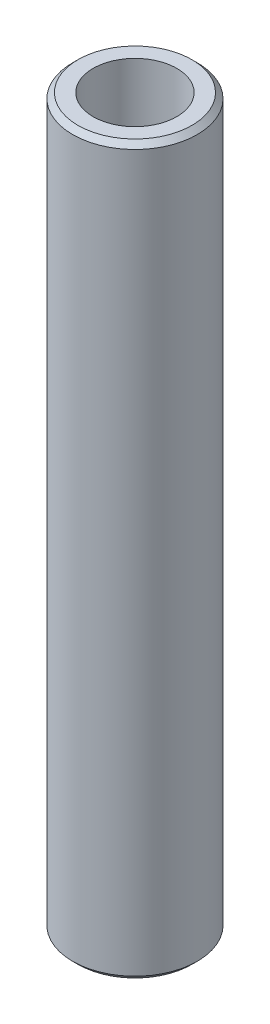
ISO-10303-21;
HEADER;
FILE_DESCRIPTION(('STEP AP214'),'2;1');
FILE_NAME('part.step','',(''),(''),'','','');
FILE_SCHEMA(('AUTOMOTIVE_DESIGN { 1 0 10303 214 1 1 1 1 }'));
ENDSEC;
DATA;
#1=APPLICATION_CONTEXT('core data for automotive mechanical design processes');
#2=APPLICATION_PROTOCOL_DEFINITION('international standard','automotive_design',2000,#1);
#3=PRODUCT_CONTEXT('',#1,'mechanical');
#4=PRODUCT('Part','Part','',(#3));
#5=PRODUCT_RELATED_PRODUCT_CATEGORY('part','',(#4));
#6=PRODUCT_DEFINITION_FORMATION('','',#4);
#7=PRODUCT_DEFINITION_CONTEXT('part definition',#1,'design');
#8=PRODUCT_DEFINITION('design','',#6,#7);
#9=PRODUCT_DEFINITION_SHAPE('','',#8);
#10=(LENGTH_UNIT() NAMED_UNIT(*) SI_UNIT(.MILLI.,.METRE.));
#11=(NAMED_UNIT(*) PLANE_ANGLE_UNIT() SI_UNIT($,.RADIAN.));
#12=(NAMED_UNIT(*) SI_UNIT($,.STERADIAN.) SOLID_ANGLE_UNIT());
#13=UNCERTAINTY_MEASURE_WITH_UNIT(LENGTH_MEASURE(1.E-05),#10,'distance_accuracy_value','');
#14=(GEOMETRIC_REPRESENTATION_CONTEXT(3) GLOBAL_UNCERTAINTY_ASSIGNED_CONTEXT((#13)) GLOBAL_UNIT_ASSIGNED_CONTEXT((#10,
#11,#12)) REPRESENTATION_CONTEXT('',''));
#15=CARTESIAN_POINT('',(0.,0.,0.));
#16=DIRECTION('',(0.,0.,1.));
#17=DIRECTION('',(1.,0.,0.));
#18=AXIS2_PLACEMENT_3D('',#15,#16,#17);
#19=CARTESIAN_POINT('',(0.,495.73439108788,0.));
#20=DIRECTION('',(0.,-1.,0.));
#21=DIRECTION('',(0.,0.,-1.));
#22=AXIS2_PLACEMENT_3D('',#19,#20,#21);
#23=CYLINDRICAL_SURFACE('',#22,42.5);
#24=CARTESIAN_POINT('',(0.,492.107803874787,0.));
#25=DIRECTION('',(0.,1.,0.));
#26=DIRECTION('',(0.,0.,1.));
#27=AXIS2_PLACEMENT_3D('',#24,#25,#26);
#28=CIRCLE('',#27,42.5);
#29=CARTESIAN_POINT('',(0.,492.107803874787,42.5));
#30=VERTEX_POINT('',#29);
#31=EDGE_CURVE('E50',#30,#30,#28,.F.);
#32=ORIENTED_EDGE('',*,*,#31,.T.);
#33=EDGE_LOOP('',(#32));
#34=FACE_BOUND('',#33,.T.);
#35=CARTESIAN_POINT('',(0.,3.62658721309322,0.));
#36=DIRECTION('',(0.,1.,0.));
#37=DIRECTION('',(0.,0.,1.));
#38=AXIS2_PLACEMENT_3D('',#35,#36,#37);
#39=CIRCLE('',#38,42.5);
#40=CARTESIAN_POINT('',(0.,3.62658721309322,42.5));
#41=VERTEX_POINT('',#40);
#42=EDGE_CURVE('E51',#41,#41,#39,.T.);
#43=ORIENTED_EDGE('',*,*,#42,.T.);
#44=EDGE_LOOP('',(#43));
#45=FACE_BOUND('',#44,.T.);
#46=ADVANCED_FACE('F39',(#34,#45),#23,.T.);
#47=CARTESIAN_POINT('',(0.,495.73439108788,0.));
#48=DIRECTION('',(0.,1.,0.));
#49=DIRECTION('',(0.,0.,1.));
#50=AXIS2_PLACEMENT_3D('',#47,#48,#49);
#51=PLANE('',#50);
#52=CARTESIAN_POINT('',(0.,495.73439108788,0.));
#53=DIRECTION('',(0.,1.,0.));
#54=DIRECTION('',(0.,0.,1.));
#55=AXIS2_PLACEMENT_3D('',#52,#53,#54);
#56=CIRCLE('',#55,38.8734127869067);
#57=CARTESIAN_POINT('',(0.,495.73439108788,38.8734127869067));
#58=VERTEX_POINT('',#57);
#59=EDGE_CURVE('E54',#58,#58,#56,.T.);
#60=ORIENTED_EDGE('',*,*,#59,.T.);
#61=EDGE_LOOP('',(#60));
#62=FACE_BOUND('',#61,.T.);
#63=CARTESIAN_POINT('',(0.,495.73439108788,0.));
#64=DIRECTION('',(0.,1.,0.));
#65=DIRECTION('',(0.,0.,1.));
#66=AXIS2_PLACEMENT_3D('',#63,#64,#65);
#67=CIRCLE('',#66,28.5580750594675);
#68=CARTESIAN_POINT('',(0.,495.73439108788,28.5580750594675));
#69=VERTEX_POINT('',#68);
#70=EDGE_CURVE('E58',#69,#69,#67,.T.);
#71=ORIENTED_EDGE('',*,*,#70,.F.);
#72=EDGE_LOOP('',(#71));
#73=FACE_BOUND('',#72,.T.);
#74=ADVANCED_FACE('F69',(#62,#73),#51,.T.);
#75=CARTESIAN_POINT('',(0.,0.,0.));
#76=DIRECTION('',(0.,1.,0.));
#77=DIRECTION('',(0.,0.,1.));
#78=AXIS2_PLACEMENT_3D('',#75,#76,#77);
#79=PLANE('',#78);
#80=CARTESIAN_POINT('',(0.,0.,0.));
#81=DIRECTION('',(0.,1.,0.));
#82=DIRECTION('',(0.,0.,1.));
#83=AXIS2_PLACEMENT_3D('',#80,#81,#82);
#84=CIRCLE('',#83,38.8734127869068);
#85=CARTESIAN_POINT('',(0.,0.,38.8734127869068));
#86=VERTEX_POINT('',#85);
#87=EDGE_CURVE('E10',#86,#86,#84,.F.);
#88=ORIENTED_EDGE('',*,*,#87,.T.);
#89=EDGE_LOOP('',(#88));
#90=FACE_BOUND('',#89,.T.);
#91=CARTESIAN_POINT('',(0.,0.,0.));
#92=DIRECTION('',(0.,1.,0.));
#93=DIRECTION('',(0.,0.,1.));
#94=AXIS2_PLACEMENT_3D('',#91,#92,#93);
#95=CIRCLE('',#94,28.5580750594675);
#96=CARTESIAN_POINT('',(0.,0.,28.5580750594675));
#97=VERTEX_POINT('',#96);
#98=EDGE_CURVE('E63',#97,#97,#95,.T.);
#99=ORIENTED_EDGE('',*,*,#98,.T.);
#100=EDGE_LOOP('',(#99));
#101=FACE_BOUND('',#100,.T.);
#102=ADVANCED_FACE('F75',(#90,#101),#79,.F.);
#103=CARTESIAN_POINT('',(0.,495.73439108788,0.));
#104=DIRECTION('',(0.,-1.,0.));
#105=DIRECTION('',(0.,0.,-1.));
#106=AXIS2_PLACEMENT_3D('',#103,#104,#105);
#107=CYLINDRICAL_SURFACE('',#106,28.5580750594675);
#108=ORIENTED_EDGE('',*,*,#70,.T.);
#109=EDGE_LOOP('',(#108));
#110=FACE_BOUND('',#109,.T.);
#111=ORIENTED_EDGE('',*,*,#98,.F.);
#112=EDGE_LOOP('',(#111));
#113=FACE_BOUND('',#112,.T.);
#114=ADVANCED_FACE('F70',(#110,#113),#107,.F.);
#115=CARTESIAN_POINT('',(0.,495.73439108788,0.));
#116=DIRECTION('',(0.,-1.,0.));
#117=DIRECTION('',(0.,0.,-1.));
#118=AXIS2_PLACEMENT_3D('',#115,#116,#117);
#119=CONICAL_SURFACE('',#118,38.8734127869067,0.785398163397452);
#120=ORIENTED_EDGE('',*,*,#31,.F.);
#121=EDGE_LOOP('',(#120));
#122=FACE_BOUND('',#121,.T.);
#123=ORIENTED_EDGE('',*,*,#59,.F.);
#124=EDGE_LOOP('',(#123));
#125=FACE_BOUND('',#124,.T.);
#126=ADVANCED_FACE('F81',(#122,#125),#119,.T.);
#127=CARTESIAN_POINT('',(0.,3.62658721309322,0.));
#128=DIRECTION('',(0.,1.,0.));
#129=DIRECTION('',(0.,0.,1.));
#130=AXIS2_PLACEMENT_3D('',#127,#128,#129);
#131=CONICAL_SURFACE('',#130,42.5,0.785398163397452);
#132=ORIENTED_EDGE('',*,*,#87,.F.);
#133=EDGE_LOOP('',(#132));
#134=FACE_BOUND('',#133,.T.);
#135=ORIENTED_EDGE('',*,*,#42,.F.);
#136=EDGE_LOOP('',(#135));
#137=FACE_BOUND('',#136,.T.);
#138=ADVANCED_FACE('F45',(#134,#137),#131,.T.);
#139=CLOSED_SHELL('',(#46,#74,#102,#114,#126,#138));
#140=MANIFOLD_SOLID_BREP('B2',#139);
#141=ADVANCED_BREP_SHAPE_REPRESENTATION('',(#18,#140),#14);
#142=SHAPE_DEFINITION_REPRESENTATION(#9,#141);
ENDSEC;
END-ISO-10303-21;
